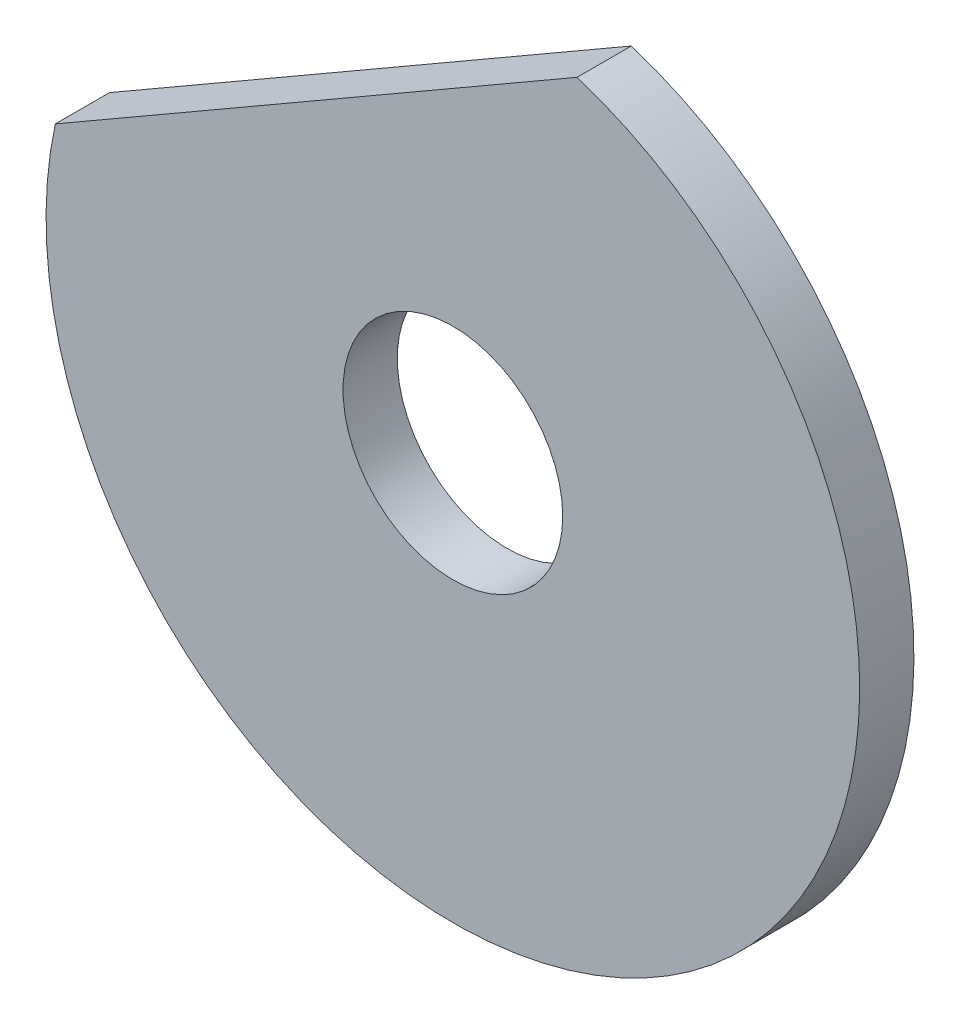
ISO-10303-21;
HEADER;
FILE_DESCRIPTION(('STEP AP214'),'2;1');
FILE_NAME('part.step','',(''),(''),'','','');
FILE_SCHEMA(('AUTOMOTIVE_DESIGN { 1 0 10303 214 1 1 1 1 }'));
ENDSEC;
DATA;
#1=APPLICATION_CONTEXT('core data for automotive mechanical design processes');
#2=APPLICATION_PROTOCOL_DEFINITION('international standard','automotive_design',2000,#1);
#3=PRODUCT_CONTEXT('',#1,'mechanical');
#4=PRODUCT('Part','Part','',(#3));
#5=PRODUCT_RELATED_PRODUCT_CATEGORY('part','',(#4));
#6=PRODUCT_DEFINITION_FORMATION('','',#4);
#7=PRODUCT_DEFINITION_CONTEXT('part definition',#1,'design');
#8=PRODUCT_DEFINITION('design','',#6,#7);
#9=PRODUCT_DEFINITION_SHAPE('','',#8);
#10=(LENGTH_UNIT() NAMED_UNIT(*) SI_UNIT(.MILLI.,.METRE.));
#11=(NAMED_UNIT(*) PLANE_ANGLE_UNIT() SI_UNIT($,.RADIAN.));
#12=(NAMED_UNIT(*) SI_UNIT($,.STERADIAN.) SOLID_ANGLE_UNIT());
#13=UNCERTAINTY_MEASURE_WITH_UNIT(LENGTH_MEASURE(1.E-05),#10,'distance_accuracy_value','');
#14=(GEOMETRIC_REPRESENTATION_CONTEXT(3) GLOBAL_UNCERTAINTY_ASSIGNED_CONTEXT((#13)) GLOBAL_UNIT_ASSIGNED_CONTEXT((#10,
#11,#12)) REPRESENTATION_CONTEXT('',''));
#15=CARTESIAN_POINT('',(0.,0.,0.));
#16=DIRECTION('',(0.,0.,1.));
#17=DIRECTION('',(1.,0.,0.));
#18=AXIS2_PLACEMENT_3D('',#15,#16,#17);
#19=CARTESIAN_POINT('',(0.,0.,2.));
#20=DIRECTION('',(0.,0.,1.));
#21=DIRECTION('',(1.,0.,0.));
#22=AXIS2_PLACEMENT_3D('',#19,#20,#21);
#23=PLANE('',#22);
#24=DIRECTION('',(0.866025403784442,0.499999999999994,0.));
#25=VECTOR('',#24,1.);
#26=CARTESIAN_POINT('',(-14.6595379993545,3.1777264900369,2.));
#27=LINE('',#26,#25);
#28=CARTESIAN_POINT('',(-14.6595379993545,3.1777264900369,2.));
#29=VERTEX_POINT('',#28);
#30=CARTESIAN_POINT('',(4.57777713302673,14.2843955602027,2.));
#31=VERTEX_POINT('',#30);
#32=EDGE_CURVE('E77',#29,#31,#27,.T.);
#33=ORIENTED_EDGE('',*,*,#32,.F.);
#34=CARTESIAN_POINT('',(0.,0.,2.));
#35=DIRECTION('',(0.,0.,1.));
#36=DIRECTION('',(1.,0.,0.));
#37=AXIS2_PLACEMENT_3D('',#34,#35,#36);
#38=CIRCLE('',#37,15.);
#39=EDGE_CURVE('E71',#29,#31,#38,.T.);
#40=ORIENTED_EDGE('',*,*,#39,.T.);
#41=EDGE_LOOP('',(#33,#40));
#42=FACE_BOUND('',#41,.T.);
#43=CARTESIAN_POINT('',(0.,0.,2.));
#44=DIRECTION('',(0.,0.,1.));
#45=DIRECTION('',(1.,0.,0.));
#46=AXIS2_PLACEMENT_3D('',#43,#44,#45);
#47=CIRCLE('',#46,4.05);
#48=CARTESIAN_POINT('',(4.05,0.,2.));
#49=VERTEX_POINT('',#48);
#50=EDGE_CURVE('E79',#49,#49,#47,.T.);
#51=ORIENTED_EDGE('',*,*,#50,.F.);
#52=EDGE_LOOP('',(#51));
#53=FACE_BOUND('',#52,.T.);
#54=ADVANCED_FACE('F43',(#42,#53),#23,.T.);
#55=CARTESIAN_POINT('',(0.,0.,0.));
#56=DIRECTION('',(0.,0.,1.));
#57=DIRECTION('',(1.,0.,0.));
#58=AXIS2_PLACEMENT_3D('',#55,#56,#57);
#59=PLANE('',#58);
#60=DIRECTION('',(0.866025403784442,0.499999999999994,0.));
#61=VECTOR('',#60,1.);
#62=CARTESIAN_POINT('',(-14.6595379993545,3.1777264900369,0.));
#63=LINE('',#62,#61);
#64=CARTESIAN_POINT('',(-14.6595379993545,3.1777264900369,0.));
#65=VERTEX_POINT('',#64);
#66=CARTESIAN_POINT('',(4.57777713302673,14.2843955602027,0.));
#67=VERTEX_POINT('',#66);
#68=EDGE_CURVE('E76',#65,#67,#63,.T.);
#69=ORIENTED_EDGE('',*,*,#68,.T.);
#70=CARTESIAN_POINT('',(0.,0.,0.));
#71=DIRECTION('',(0.,0.,1.));
#72=DIRECTION('',(1.,0.,0.));
#73=AXIS2_PLACEMENT_3D('',#70,#71,#72);
#74=CIRCLE('',#73,15.);
#75=EDGE_CURVE('E69',#65,#67,#74,.T.);
#76=ORIENTED_EDGE('',*,*,#75,.F.);
#77=EDGE_LOOP('',(#69,#76));
#78=FACE_BOUND('',#77,.T.);
#79=CARTESIAN_POINT('',(0.,0.,0.));
#80=DIRECTION('',(0.,0.,1.));
#81=DIRECTION('',(1.,0.,0.));
#82=AXIS2_PLACEMENT_3D('',#79,#80,#81);
#83=CIRCLE('',#82,4.05);
#84=CARTESIAN_POINT('',(4.05,0.,0.));
#85=VERTEX_POINT('',#84);
#86=EDGE_CURVE('E82',#85,#85,#83,.T.);
#87=ORIENTED_EDGE('',*,*,#86,.T.);
#88=EDGE_LOOP('',(#87));
#89=FACE_BOUND('',#88,.T.);
#90=ADVANCED_FACE('F74',(#78,#89),#59,.F.);
#91=CARTESIAN_POINT('',(-14.6595379993545,3.1777264900369,2.));
#92=DIRECTION('',(-0.499999999999994,0.866025403784442,0.));
#93=DIRECTION('',(-0.866025403784442,-0.499999999999994,0.));
#94=AXIS2_PLACEMENT_3D('',#91,#92,#93);
#95=PLANE('',#94);
#96=ORIENTED_EDGE('',*,*,#68,.F.);
#97=DIRECTION('',(0.,0.,-1.));
#98=VECTOR('',#97,1.);
#99=CARTESIAN_POINT('',(-14.6595379993545,3.1777264900369,2.));
#100=LINE('',#99,#98);
#101=EDGE_CURVE('E12',#29,#65,#100,.T.);
#102=ORIENTED_EDGE('',*,*,#101,.F.);
#103=ORIENTED_EDGE('',*,*,#32,.T.);
#104=DIRECTION('',(0.,0.,-1.));
#105=VECTOR('',#104,1.);
#106=CARTESIAN_POINT('',(4.57777713302673,14.2843955602027,2.));
#107=LINE('',#106,#105);
#108=EDGE_CURVE('E47',#31,#67,#107,.T.);
#109=ORIENTED_EDGE('',*,*,#108,.T.);
#110=EDGE_LOOP('',(#96,#102,#103,#109));
#111=FACE_BOUND('',#110,.T.);
#112=ADVANCED_FACE('F45',(#111),#95,.T.);
#113=CARTESIAN_POINT('',(0.,0.,2.));
#114=DIRECTION('',(0.,0.,-1.));
#115=DIRECTION('',(-1.,0.,0.));
#116=AXIS2_PLACEMENT_3D('',#113,#114,#115);
#117=CYLINDRICAL_SURFACE('',#116,15.);
#118=ORIENTED_EDGE('',*,*,#75,.T.);
#119=ORIENTED_EDGE('',*,*,#108,.F.);
#120=ORIENTED_EDGE('',*,*,#39,.F.);
#121=ORIENTED_EDGE('',*,*,#101,.T.);
#122=EDGE_LOOP('',(#118,#119,#120,#121));
#123=FACE_BOUND('',#122,.T.);
#124=ADVANCED_FACE('F68',(#123),#117,.T.);
#125=CARTESIAN_POINT('',(0.,0.,2.));
#126=DIRECTION('',(0.,0.,-1.));
#127=DIRECTION('',(-1.,0.,0.));
#128=AXIS2_PLACEMENT_3D('',#125,#126,#127);
#129=CYLINDRICAL_SURFACE('',#128,4.05);
#130=ORIENTED_EDGE('',*,*,#50,.T.);
#131=EDGE_LOOP('',(#130));
#132=FACE_BOUND('',#131,.T.);
#133=ORIENTED_EDGE('',*,*,#86,.F.);
#134=EDGE_LOOP('',(#133));
#135=FACE_BOUND('',#134,.T.);
#136=ADVANCED_FACE('F90',(#132,#135),#129,.F.);
#137=CLOSED_SHELL('',(#54,#90,#112,#124,#136));
#138=MANIFOLD_SOLID_BREP('B2',#137);
#139=ADVANCED_BREP_SHAPE_REPRESENTATION('',(#18,#138),#14);
#140=SHAPE_DEFINITION_REPRESENTATION(#9,#139);
ENDSEC;
END-ISO-10303-21;
